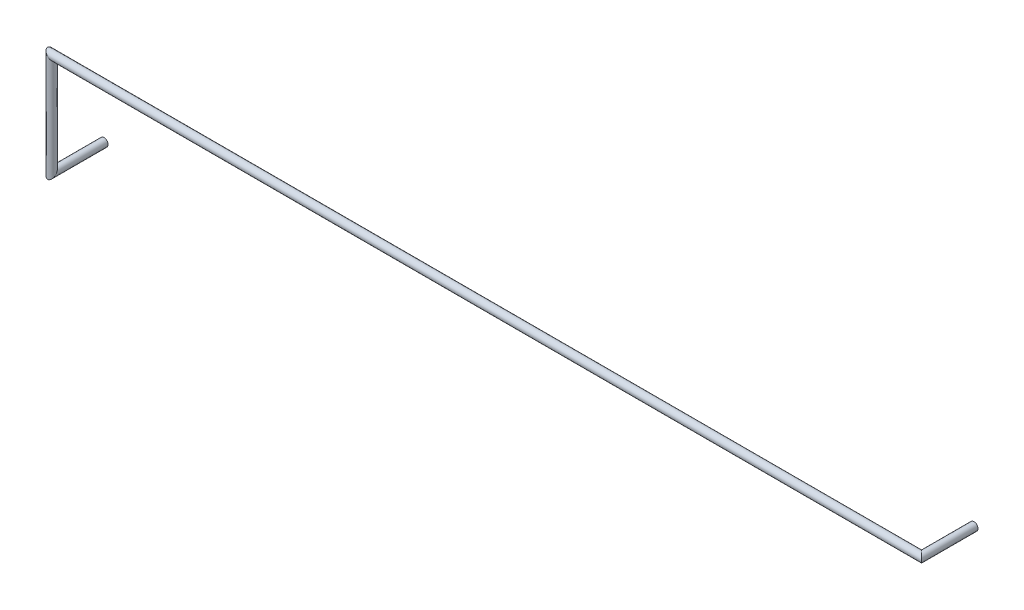
ISO-10303-21;
HEADER;
FILE_DESCRIPTION(('STEP AP214'),'2;1');
FILE_NAME('part.step','',(''),(''),'','','');
FILE_SCHEMA(('AUTOMOTIVE_DESIGN { 1 0 10303 214 1 1 1 1 }'));
ENDSEC;
DATA;
#1=APPLICATION_CONTEXT('core data for automotive mechanical design processes');
#2=APPLICATION_PROTOCOL_DEFINITION('international standard','automotive_design',2000,#1);
#3=PRODUCT_CONTEXT('',#1,'mechanical');
#4=PRODUCT('Part','Part','',(#3));
#5=PRODUCT_RELATED_PRODUCT_CATEGORY('part','',(#4));
#6=PRODUCT_DEFINITION_FORMATION('','',#4);
#7=PRODUCT_DEFINITION_CONTEXT('part definition',#1,'design');
#8=PRODUCT_DEFINITION('design','',#6,#7);
#9=PRODUCT_DEFINITION_SHAPE('','',#8);
#10=(LENGTH_UNIT() NAMED_UNIT(*) SI_UNIT(.MILLI.,.METRE.));
#11=(NAMED_UNIT(*) PLANE_ANGLE_UNIT() SI_UNIT($,.RADIAN.));
#12=(NAMED_UNIT(*) SI_UNIT($,.STERADIAN.) SOLID_ANGLE_UNIT());
#13=UNCERTAINTY_MEASURE_WITH_UNIT(LENGTH_MEASURE(1.E-05),#10,'distance_accuracy_value','');
#14=(GEOMETRIC_REPRESENTATION_CONTEXT(3) GLOBAL_UNCERTAINTY_ASSIGNED_CONTEXT((#13)) GLOBAL_UNIT_ASSIGNED_CONTEXT((#10,
#11,#12)) REPRESENTATION_CONTEXT('',''));
#15=CARTESIAN_POINT('',(0.,0.,0.));
#16=DIRECTION('',(0.,0.,1.));
#17=DIRECTION('',(1.,0.,0.));
#18=AXIS2_PLACEMENT_3D('',#15,#16,#17);
#19=CARTESIAN_POINT('',(43.18,5.08,0.));
#20=DIRECTION('',(0.,0.,1.));
#21=DIRECTION('',(1.,0.,0.));
#22=AXIS2_PLACEMENT_3D('',#19,#20,#21);
#23=PLANE('',#22);
#24=CARTESIAN_POINT('',(43.18,5.08,0.));
#25=DIRECTION('',(0.,0.,1.));
#26=DIRECTION('',(1.,0.,0.));
#27=AXIS2_PLACEMENT_3D('',#24,#25,#26);
#28=CIRCLE('',#27,0.199999999999999);
#29=CARTESIAN_POINT('',(43.38,5.08,0.));
#30=VERTEX_POINT('',#29);
#31=EDGE_CURVE('E52',#30,#30,#28,.T.);
#32=ORIENTED_EDGE('',*,*,#31,.F.);
#33=EDGE_LOOP('',(#32));
#34=FACE_BOUND('',#33,.T.);
#35=ADVANCED_FACE('F49',(#34),#23,.F.);
#36=CARTESIAN_POINT('',(0.,0.,0.));
#37=DIRECTION('',(0.,0.,-1.));
#38=DIRECTION('',(0.,-1.,0.));
#39=AXIS2_PLACEMENT_3D('',#36,#37,#38);
#40=PLANE('',#39);
#41=CARTESIAN_POINT('',(0.,0.,0.));
#42=DIRECTION('',(0.,0.,-1.));
#43=DIRECTION('',(0.,-1.,0.));
#44=AXIS2_PLACEMENT_3D('',#41,#42,#43);
#45=CIRCLE('',#44,0.199999999999999);
#46=CARTESIAN_POINT('',(0.,-0.199999999999999,0.));
#47=VERTEX_POINT('',#46);
#48=EDGE_CURVE('E57',#47,#47,#45,.T.);
#49=ORIENTED_EDGE('',*,*,#48,.T.);
#50=EDGE_LOOP('',(#49));
#51=FACE_BOUND('',#50,.T.);
#52=ADVANCED_FACE('F80',(#51),#40,.T.);
#53=CARTESIAN_POINT('',(43.18,5.08,2.92));
#54=DIRECTION('',(0.,0.,-1.));
#55=DIRECTION('',(-1.,0.,0.));
#56=AXIS2_PLACEMENT_3D('',#53,#54,#55);
#57=CYLINDRICAL_SURFACE('',#56,0.199999999999999);
#58=CARTESIAN_POINT('',(43.18,5.08,2.6));
#59=DIRECTION('',(0.707106781186548,0.,-0.707106781186548));
#60=DIRECTION('',(0.707106781186548,0.,0.707106781186548));
#61=AXIS2_PLACEMENT_3D('',#58,#59,#60);
#62=ELLIPSE('',#61,0.282842712474617,0.199999999999999);
#63=CARTESIAN_POINT('',(43.38,5.08,2.8));
#64=VERTEX_POINT('',#63);
#65=EDGE_CURVE('E68',#64,#64,#62,.T.);
#66=ORIENTED_EDGE('',*,*,#65,.T.);
#67=EDGE_LOOP('',(#66));
#68=FACE_BOUND('',#67,.T.);
#69=ORIENTED_EDGE('',*,*,#31,.T.);
#70=EDGE_LOOP('',(#69));
#71=FACE_BOUND('',#70,.T.);
#72=ADVANCED_FACE('F77',(#68,#71),#57,.T.);
#73=CARTESIAN_POINT('',(-0.539999999999997,5.08,2.6));
#74=DIRECTION('',(1.,0.,0.));
#75=DIRECTION('',(0.,0.,-1.));
#76=AXIS2_PLACEMENT_3D('',#73,#74,#75);
#77=CYLINDRICAL_SURFACE('',#76,0.199999999999999);
#78=CARTESIAN_POINT('',(0.,5.08,2.6));
#79=DIRECTION('',(0.707106781186548,0.707106781186548,0.));
#80=DIRECTION('',(-0.707106781186548,0.707106781186548,0.));
#81=AXIS2_PLACEMENT_3D('',#78,#79,#80);
#82=ELLIPSE('',#81,0.282842712474617,0.199999999999999);
#83=CARTESIAN_POINT('',(-0.199999999999999,5.28,2.6));
#84=VERTEX_POINT('',#83);
#85=EDGE_CURVE('E63',#84,#84,#82,.T.);
#86=ORIENTED_EDGE('',*,*,#85,.T.);
#87=EDGE_LOOP('',(#86));
#88=FACE_BOUND('',#87,.T.);
#89=ORIENTED_EDGE('',*,*,#65,.F.);
#90=EDGE_LOOP('',(#89));
#91=FACE_BOUND('',#90,.T.);
#92=ADVANCED_FACE('F93',(#88,#91),#77,.T.);
#93=CARTESIAN_POINT('',(0.,-0.319999999999996,2.6));
#94=DIRECTION('',(0.,1.,0.));
#95=DIRECTION('',(-1.,0.,0.));
#96=AXIS2_PLACEMENT_3D('',#93,#94,#95);
#97=CYLINDRICAL_SURFACE('',#96,0.199999999999999);
#98=CARTESIAN_POINT('',(0.,0.,2.6));
#99=DIRECTION('',(0.,0.707106781186548,0.707106781186548));
#100=DIRECTION('',(0.,-0.707106781186548,0.707106781186548));
#101=AXIS2_PLACEMENT_3D('',#98,#99,#100);
#102=ELLIPSE('',#101,0.282842712474617,0.199999999999999);
#103=CARTESIAN_POINT('',(0.,-0.199999999999999,2.8));
#104=VERTEX_POINT('',#103);
#105=EDGE_CURVE('E11',#104,#104,#102,.T.);
#106=ORIENTED_EDGE('',*,*,#105,.T.);
#107=EDGE_LOOP('',(#106));
#108=FACE_BOUND('',#107,.T.);
#109=ORIENTED_EDGE('',*,*,#85,.F.);
#110=EDGE_LOOP('',(#109));
#111=FACE_BOUND('',#110,.T.);
#112=ADVANCED_FACE('F87',(#108,#111),#97,.T.);
#113=CARTESIAN_POINT('',(0.,0.,0.));
#114=DIRECTION('',(0.,0.,1.));
#115=DIRECTION('',(1.,0.,0.));
#116=AXIS2_PLACEMENT_3D('',#113,#114,#115);
#117=CYLINDRICAL_SURFACE('',#116,0.199999999999999);
#118=ORIENTED_EDGE('',*,*,#48,.F.);
#119=EDGE_LOOP('',(#118));
#120=FACE_BOUND('',#119,.T.);
#121=ORIENTED_EDGE('',*,*,#105,.F.);
#122=EDGE_LOOP('',(#121));
#123=FACE_BOUND('',#122,.T.);
#124=ADVANCED_FACE('F85',(#120,#123),#117,.T.);
#125=CLOSED_SHELL('',(#35,#52,#72,#92,#112,#124));
#126=MANIFOLD_SOLID_BREP('B2',#125);
#127=ADVANCED_BREP_SHAPE_REPRESENTATION('',(#18,#126),#14);
#128=SHAPE_DEFINITION_REPRESENTATION(#9,#127);
ENDSEC;
END-ISO-10303-21;
